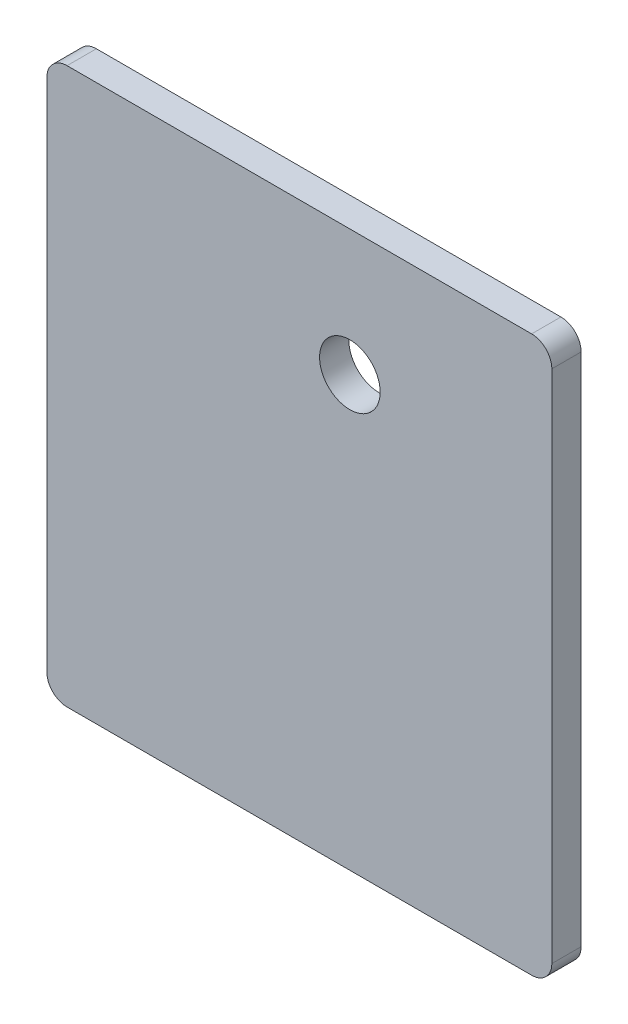
ISO-10303-21;
HEADER;
FILE_DESCRIPTION(('STEP AP214'),'2;1');
FILE_NAME('part.step','',(''),(''),'','','');
FILE_SCHEMA(('AUTOMOTIVE_DESIGN { 1 0 10303 214 1 1 1 1 }'));
ENDSEC;
DATA;
#1=APPLICATION_CONTEXT('core data for automotive mechanical design processes');
#2=APPLICATION_PROTOCOL_DEFINITION('international standard','automotive_design',2000,#1);
#3=PRODUCT_CONTEXT('',#1,'mechanical');
#4=PRODUCT('Part','Part','',(#3));
#5=PRODUCT_RELATED_PRODUCT_CATEGORY('part','',(#4));
#6=PRODUCT_DEFINITION_FORMATION('','',#4);
#7=PRODUCT_DEFINITION_CONTEXT('part definition',#1,'design');
#8=PRODUCT_DEFINITION('design','',#6,#7);
#9=PRODUCT_DEFINITION_SHAPE('','',#8);
#10=(LENGTH_UNIT() NAMED_UNIT(*) SI_UNIT(.MILLI.,.METRE.));
#11=(NAMED_UNIT(*) PLANE_ANGLE_UNIT() SI_UNIT($,.RADIAN.));
#12=(NAMED_UNIT(*) SI_UNIT($,.STERADIAN.) SOLID_ANGLE_UNIT());
#13=UNCERTAINTY_MEASURE_WITH_UNIT(LENGTH_MEASURE(1.E-05),#10,'distance_accuracy_value','');
#14=(GEOMETRIC_REPRESENTATION_CONTEXT(3) GLOBAL_UNCERTAINTY_ASSIGNED_CONTEXT((#13)) GLOBAL_UNIT_ASSIGNED_CONTEXT((#10,
#11,#12)) REPRESENTATION_CONTEXT('',''));
#15=CARTESIAN_POINT('',(0.,0.,0.));
#16=DIRECTION('',(0.,0.,1.));
#17=DIRECTION('',(1.,0.,0.));
#18=AXIS2_PLACEMENT_3D('',#15,#16,#17);
#19=CARTESIAN_POINT('',(0.,0.,2.9));
#20=DIRECTION('',(0.,0.,-1.));
#21=DIRECTION('',(-1.,0.,0.));
#22=AXIS2_PLACEMENT_3D('',#19,#20,#21);
#23=PLANE('',#22);
#24=DIRECTION('',(-1.,0.,0.));
#25=VECTOR('',#24,1.);
#26=CARTESIAN_POINT('',(0.,55.,2.9));
#27=LINE('',#26,#25);
#28=CARTESIAN_POINT('',(48.,55.,2.9));
#29=VERTEX_POINT('',#28);
#30=CARTESIAN_POINT('',(2.,55.,2.9));
#31=VERTEX_POINT('',#30);
#32=EDGE_CURVE('E126',#29,#31,#27,.T.);
#33=ORIENTED_EDGE('',*,*,#32,.T.);
#34=CARTESIAN_POINT('',(2.,53.,2.9));
#35=DIRECTION('',(0.,0.,-1.));
#36=DIRECTION('',(-1.,0.,0.));
#37=AXIS2_PLACEMENT_3D('',#34,#35,#36);
#38=CIRCLE('',#37,2.);
#39=CARTESIAN_POINT('',(0.,53.,2.9));
#40=VERTEX_POINT('',#39);
#41=EDGE_CURVE('E51',#31,#40,#38,.F.);
#42=ORIENTED_EDGE('',*,*,#41,.T.);
#43=DIRECTION('',(0.,-1.,0.));
#44=VECTOR('',#43,1.);
#45=CARTESIAN_POINT('',(0.,0.,2.9));
#46=LINE('',#45,#44);
#47=CARTESIAN_POINT('',(0.,2.,2.9));
#48=VERTEX_POINT('',#47);
#49=EDGE_CURVE('E136',#40,#48,#46,.T.);
#50=ORIENTED_EDGE('',*,*,#49,.T.);
#51=CARTESIAN_POINT('',(2.,2.,2.9));
#52=DIRECTION('',(0.,0.,-1.));
#53=DIRECTION('',(-1.,0.,0.));
#54=AXIS2_PLACEMENT_3D('',#51,#52,#53);
#55=CIRCLE('',#54,2.);
#56=CARTESIAN_POINT('',(2.,0.,2.9));
#57=VERTEX_POINT('',#56);
#58=EDGE_CURVE('E147',#48,#57,#55,.F.);
#59=ORIENTED_EDGE('',*,*,#58,.T.);
#60=DIRECTION('',(1.,0.,0.));
#61=VECTOR('',#60,1.);
#62=CARTESIAN_POINT('',(0.,0.,2.9));
#63=LINE('',#62,#61);
#64=CARTESIAN_POINT('',(48.,0.,2.9));
#65=VERTEX_POINT('',#64);
#66=EDGE_CURVE('E175',#57,#65,#63,.T.);
#67=ORIENTED_EDGE('',*,*,#66,.T.);
#68=CARTESIAN_POINT('',(48.,2.,2.9));
#69=DIRECTION('',(0.,0.,-1.));
#70=DIRECTION('',(-1.,0.,0.));
#71=AXIS2_PLACEMENT_3D('',#68,#69,#70);
#72=CIRCLE('',#71,2.);
#73=CARTESIAN_POINT('',(50.,2.,2.9));
#74=VERTEX_POINT('',#73);
#75=EDGE_CURVE('E149',#65,#74,#72,.F.);
#76=ORIENTED_EDGE('',*,*,#75,.T.);
#77=DIRECTION('',(0.,1.,0.));
#78=VECTOR('',#77,1.);
#79=CARTESIAN_POINT('',(50.,0.,2.9));
#80=LINE('',#79,#78);
#81=CARTESIAN_POINT('',(50.,53.,2.9));
#82=VERTEX_POINT('',#81);
#83=EDGE_CURVE('E125',#74,#82,#80,.T.);
#84=ORIENTED_EDGE('',*,*,#83,.T.);
#85=CARTESIAN_POINT('',(48.,53.,2.9));
#86=DIRECTION('',(0.,0.,-1.));
#87=DIRECTION('',(-1.,0.,0.));
#88=AXIS2_PLACEMENT_3D('',#85,#86,#87);
#89=CIRCLE('',#88,2.);
#90=EDGE_CURVE('E164',#82,#29,#89,.F.);
#91=ORIENTED_EDGE('',*,*,#90,.T.);
#92=EDGE_LOOP('',(#33,#42,#50,#59,#67,#76,#84,#91));
#93=FACE_BOUND('',#92,.T.);
#94=CARTESIAN_POINT('',(30.,42.5,2.9));
#95=DIRECTION('',(0.,0.,1.));
#96=DIRECTION('',(1.,0.,0.));
#97=AXIS2_PLACEMENT_3D('',#94,#95,#96);
#98=CIRCLE('',#97,3.);
#99=CARTESIAN_POINT('',(33.,42.5,2.9));
#100=VERTEX_POINT('',#99);
#101=EDGE_CURVE('E186',#100,#100,#98,.T.);
#102=ORIENTED_EDGE('',*,*,#101,.F.);
#103=EDGE_LOOP('',(#102));
#104=FACE_BOUND('',#103,.T.);
#105=ADVANCED_FACE('F43',(#93,#104),#23,.F.);
#106=CARTESIAN_POINT('',(0.,0.,0.));
#107=DIRECTION('',(0.,0.,-1.));
#108=DIRECTION('',(-1.,0.,0.));
#109=AXIS2_PLACEMENT_3D('',#106,#107,#108);
#110=PLANE('',#109);
#111=DIRECTION('',(0.,-1.,0.));
#112=VECTOR('',#111,1.);
#113=CARTESIAN_POINT('',(0.,0.,0.));
#114=LINE('',#113,#112);
#115=CARTESIAN_POINT('',(0.,53.,0.));
#116=VERTEX_POINT('',#115);
#117=CARTESIAN_POINT('',(0.,2.,0.));
#118=VERTEX_POINT('',#117);
#119=EDGE_CURVE('E138',#116,#118,#114,.T.);
#120=ORIENTED_EDGE('',*,*,#119,.F.);
#121=CARTESIAN_POINT('',(2.,53.,0.));
#122=DIRECTION('',(0.,0.,-1.));
#123=DIRECTION('',(-1.,0.,0.));
#124=AXIS2_PLACEMENT_3D('',#121,#122,#123);
#125=CIRCLE('',#124,2.);
#126=CARTESIAN_POINT('',(2.,55.,0.));
#127=VERTEX_POINT('',#126);
#128=EDGE_CURVE('E158',#116,#127,#125,.T.);
#129=ORIENTED_EDGE('',*,*,#128,.T.);
#130=DIRECTION('',(-1.,0.,0.));
#131=VECTOR('',#130,1.);
#132=CARTESIAN_POINT('',(0.,55.,0.));
#133=LINE('',#132,#131);
#134=CARTESIAN_POINT('',(48.,55.,0.));
#135=VERTEX_POINT('',#134);
#136=EDGE_CURVE('E133',#135,#127,#133,.T.);
#137=ORIENTED_EDGE('',*,*,#136,.F.);
#138=CARTESIAN_POINT('',(48.,53.,0.));
#139=DIRECTION('',(0.,0.,-1.));
#140=DIRECTION('',(-1.,0.,0.));
#141=AXIS2_PLACEMENT_3D('',#138,#139,#140);
#142=CIRCLE('',#141,2.);
#143=CARTESIAN_POINT('',(50.,53.,0.));
#144=VERTEX_POINT('',#143);
#145=EDGE_CURVE('E132',#135,#144,#142,.T.);
#146=ORIENTED_EDGE('',*,*,#145,.T.);
#147=DIRECTION('',(0.,1.,0.));
#148=VECTOR('',#147,1.);
#149=CARTESIAN_POINT('',(50.,0.,0.));
#150=LINE('',#149,#148);
#151=CARTESIAN_POINT('',(50.,2.,0.));
#152=VERTEX_POINT('',#151);
#153=EDGE_CURVE('E124',#152,#144,#150,.T.);
#154=ORIENTED_EDGE('',*,*,#153,.F.);
#155=CARTESIAN_POINT('',(48.,2.,0.));
#156=DIRECTION('',(0.,0.,-1.));
#157=DIRECTION('',(-1.,0.,0.));
#158=AXIS2_PLACEMENT_3D('',#155,#156,#157);
#159=CIRCLE('',#158,2.);
#160=CARTESIAN_POINT('',(48.,0.,0.));
#161=VERTEX_POINT('',#160);
#162=EDGE_CURVE('E110',#152,#161,#159,.T.);
#163=ORIENTED_EDGE('',*,*,#162,.T.);
#164=DIRECTION('',(1.,0.,0.));
#165=VECTOR('',#164,1.);
#166=CARTESIAN_POINT('',(0.,0.,0.));
#167=LINE('',#166,#165);
#168=CARTESIAN_POINT('',(2.,0.,0.));
#169=VERTEX_POINT('',#168);
#170=EDGE_CURVE('E134',#169,#161,#167,.T.);
#171=ORIENTED_EDGE('',*,*,#170,.F.);
#172=CARTESIAN_POINT('',(2.,2.,0.));
#173=DIRECTION('',(0.,0.,-1.));
#174=DIRECTION('',(-1.,0.,0.));
#175=AXIS2_PLACEMENT_3D('',#172,#173,#174);
#176=CIRCLE('',#175,2.);
#177=EDGE_CURVE('E121',#169,#118,#176,.T.);
#178=ORIENTED_EDGE('',*,*,#177,.T.);
#179=EDGE_LOOP('',(#120,#129,#137,#146,#154,#163,#171,#178));
#180=FACE_BOUND('',#179,.T.);
#181=CARTESIAN_POINT('',(30.,42.5,0.));
#182=DIRECTION('',(0.,0.,1.));
#183=DIRECTION('',(1.,0.,0.));
#184=AXIS2_PLACEMENT_3D('',#181,#182,#183);
#185=CIRCLE('',#184,3.);
#186=CARTESIAN_POINT('',(33.,42.5,0.));
#187=VERTEX_POINT('',#186);
#188=EDGE_CURVE('E188',#187,#187,#185,.T.);
#189=ORIENTED_EDGE('',*,*,#188,.T.);
#190=EDGE_LOOP('',(#189));
#191=FACE_BOUND('',#190,.T.);
#192=ADVANCED_FACE('F129',(#180,#191),#110,.T.);
#193=CARTESIAN_POINT('',(0.,0.,2.9));
#194=DIRECTION('',(1.,0.,0.));
#195=DIRECTION('',(0.,0.,-1.));
#196=AXIS2_PLACEMENT_3D('',#193,#194,#195);
#197=PLANE('',#196);
#198=ORIENTED_EDGE('',*,*,#49,.F.);
#199=DIRECTION('',(0.,0.,-1.));
#200=VECTOR('',#199,1.);
#201=CARTESIAN_POINT('',(0.,53.,2.9));
#202=LINE('',#201,#200);
#203=EDGE_CURVE('E154',#40,#116,#202,.T.);
#204=ORIENTED_EDGE('',*,*,#203,.T.);
#205=ORIENTED_EDGE('',*,*,#119,.T.);
#206=DIRECTION('',(0.,0.,-1.));
#207=VECTOR('',#206,1.);
#208=CARTESIAN_POINT('',(0.,2.,2.9));
#209=LINE('',#208,#207);
#210=EDGE_CURVE('E151',#118,#48,#209,.F.);
#211=ORIENTED_EDGE('',*,*,#210,.T.);
#212=EDGE_LOOP('',(#198,#204,#205,#211));
#213=FACE_BOUND('',#212,.T.);
#214=ADVANCED_FACE('F172',(#213),#197,.F.);
#215=CARTESIAN_POINT('',(0.,0.,2.9));
#216=DIRECTION('',(0.,1.,0.));
#217=DIRECTION('',(0.,0.,1.));
#218=AXIS2_PLACEMENT_3D('',#215,#216,#217);
#219=PLANE('',#218);
#220=ORIENTED_EDGE('',*,*,#170,.T.);
#221=DIRECTION('',(0.,0.,-1.));
#222=VECTOR('',#221,1.);
#223=CARTESIAN_POINT('',(48.,0.,2.9));
#224=LINE('',#223,#222);
#225=EDGE_CURVE('E115',#161,#65,#224,.F.);
#226=ORIENTED_EDGE('',*,*,#225,.T.);
#227=ORIENTED_EDGE('',*,*,#66,.F.);
#228=DIRECTION('',(0.,0.,-1.));
#229=VECTOR('',#228,1.);
#230=CARTESIAN_POINT('',(2.,0.,2.9));
#231=LINE('',#230,#229);
#232=EDGE_CURVE('E120',#57,#169,#231,.T.);
#233=ORIENTED_EDGE('',*,*,#232,.T.);
#234=EDGE_LOOP('',(#220,#226,#227,#233));
#235=FACE_BOUND('',#234,.T.);
#236=ADVANCED_FACE('F217',(#235),#219,.F.);
#237=CARTESIAN_POINT('',(50.,0.,2.9));
#238=DIRECTION('',(-1.,0.,0.));
#239=DIRECTION('',(0.,0.,1.));
#240=AXIS2_PLACEMENT_3D('',#237,#238,#239);
#241=PLANE('',#240);
#242=ORIENTED_EDGE('',*,*,#153,.T.);
#243=DIRECTION('',(0.,0.,-1.));
#244=VECTOR('',#243,1.);
#245=CARTESIAN_POINT('',(50.,53.,2.9));
#246=LINE('',#245,#244);
#247=EDGE_CURVE('E11',#144,#82,#246,.F.);
#248=ORIENTED_EDGE('',*,*,#247,.T.);
#249=ORIENTED_EDGE('',*,*,#83,.F.);
#250=DIRECTION('',(0.,0.,-1.));
#251=VECTOR('',#250,1.);
#252=CARTESIAN_POINT('',(50.,2.,2.9));
#253=LINE('',#252,#251);
#254=EDGE_CURVE('E114',#74,#152,#253,.T.);
#255=ORIENTED_EDGE('',*,*,#254,.T.);
#256=EDGE_LOOP('',(#242,#248,#249,#255));
#257=FACE_BOUND('',#256,.T.);
#258=ADVANCED_FACE('F123',(#257),#241,.F.);
#259=CARTESIAN_POINT('',(0.,55.,2.9));
#260=DIRECTION('',(0.,-1.,0.));
#261=DIRECTION('',(0.,0.,-1.));
#262=AXIS2_PLACEMENT_3D('',#259,#260,#261);
#263=PLANE('',#262);
#264=ORIENTED_EDGE('',*,*,#136,.T.);
#265=DIRECTION('',(0.,0.,-1.));
#266=VECTOR('',#265,1.);
#267=CARTESIAN_POINT('',(2.,55.,2.9));
#268=LINE('',#267,#266);
#269=EDGE_CURVE('E64',#127,#31,#268,.F.);
#270=ORIENTED_EDGE('',*,*,#269,.T.);
#271=ORIENTED_EDGE('',*,*,#32,.F.);
#272=DIRECTION('',(0.,0.,-1.));
#273=VECTOR('',#272,1.);
#274=CARTESIAN_POINT('',(48.,55.,2.9));
#275=LINE('',#274,#273);
#276=EDGE_CURVE('E160',#29,#135,#275,.T.);
#277=ORIENTED_EDGE('',*,*,#276,.T.);
#278=EDGE_LOOP('',(#264,#270,#271,#277));
#279=FACE_BOUND('',#278,.T.);
#280=ADVANCED_FACE('F178',(#279),#263,.F.);
#281=CARTESIAN_POINT('',(30.,42.5,2.9));
#282=DIRECTION('',(0.,0.,-1.));
#283=DIRECTION('',(-1.,0.,0.));
#284=AXIS2_PLACEMENT_3D('',#281,#282,#283);
#285=CYLINDRICAL_SURFACE('',#284,3.);
#286=ORIENTED_EDGE('',*,*,#101,.T.);
#287=EDGE_LOOP('',(#286));
#288=FACE_BOUND('',#287,.T.);
#289=ORIENTED_EDGE('',*,*,#188,.F.);
#290=EDGE_LOOP('',(#289));
#291=FACE_BOUND('',#290,.T.);
#292=ADVANCED_FACE('F196',(#288,#291),#285,.F.);
#293=CARTESIAN_POINT('',(48.,2.,2.9));
#294=DIRECTION('',(0.,0.,-1.));
#295=DIRECTION('',(-1.,0.,0.));
#296=AXIS2_PLACEMENT_3D('',#293,#294,#295);
#297=CYLINDRICAL_SURFACE('',#296,2.);
#298=ORIENTED_EDGE('',*,*,#75,.F.);
#299=ORIENTED_EDGE('',*,*,#225,.F.);
#300=ORIENTED_EDGE('',*,*,#162,.F.);
#301=ORIENTED_EDGE('',*,*,#254,.F.);
#302=EDGE_LOOP('',(#298,#299,#300,#301));
#303=FACE_BOUND('',#302,.T.);
#304=ADVANCED_FACE('F113',(#303),#297,.T.);
#305=CARTESIAN_POINT('',(2.,2.,2.9));
#306=DIRECTION('',(0.,0.,-1.));
#307=DIRECTION('',(-1.,0.,0.));
#308=AXIS2_PLACEMENT_3D('',#305,#306,#307);
#309=CYLINDRICAL_SURFACE('',#308,2.);
#310=ORIENTED_EDGE('',*,*,#58,.F.);
#311=ORIENTED_EDGE('',*,*,#210,.F.);
#312=ORIENTED_EDGE('',*,*,#177,.F.);
#313=ORIENTED_EDGE('',*,*,#232,.F.);
#314=EDGE_LOOP('',(#310,#311,#312,#313));
#315=FACE_BOUND('',#314,.T.);
#316=ADVANCED_FACE('F203',(#315),#309,.T.);
#317=CARTESIAN_POINT('',(2.,53.,2.9));
#318=DIRECTION('',(0.,0.,-1.));
#319=DIRECTION('',(-1.,0.,0.));
#320=AXIS2_PLACEMENT_3D('',#317,#318,#319);
#321=CYLINDRICAL_SURFACE('',#320,2.);
#322=ORIENTED_EDGE('',*,*,#41,.F.);
#323=ORIENTED_EDGE('',*,*,#269,.F.);
#324=ORIENTED_EDGE('',*,*,#128,.F.);
#325=ORIENTED_EDGE('',*,*,#203,.F.);
#326=EDGE_LOOP('',(#322,#323,#324,#325));
#327=FACE_BOUND('',#326,.T.);
#328=ADVANCED_FACE('F177',(#327),#321,.T.);
#329=CARTESIAN_POINT('',(48.,53.,2.9));
#330=DIRECTION('',(0.,0.,-1.));
#331=DIRECTION('',(-1.,0.,0.));
#332=AXIS2_PLACEMENT_3D('',#329,#330,#331);
#333=CYLINDRICAL_SURFACE('',#332,2.);
#334=ORIENTED_EDGE('',*,*,#90,.F.);
#335=ORIENTED_EDGE('',*,*,#247,.F.);
#336=ORIENTED_EDGE('',*,*,#145,.F.);
#337=ORIENTED_EDGE('',*,*,#276,.F.);
#338=EDGE_LOOP('',(#334,#335,#336,#337));
#339=FACE_BOUND('',#338,.T.);
#340=ADVANCED_FACE('F45',(#339),#333,.T.);
#341=CLOSED_SHELL('',(#105,#192,#214,#236,#258,#280,#292,#304,#316,#328,#340));
#342=MANIFOLD_SOLID_BREP('B2',#341);
#343=ADVANCED_BREP_SHAPE_REPRESENTATION('',(#18,#342),#14);
#344=SHAPE_DEFINITION_REPRESENTATION(#9,#343);
ENDSEC;
END-ISO-10303-21;
